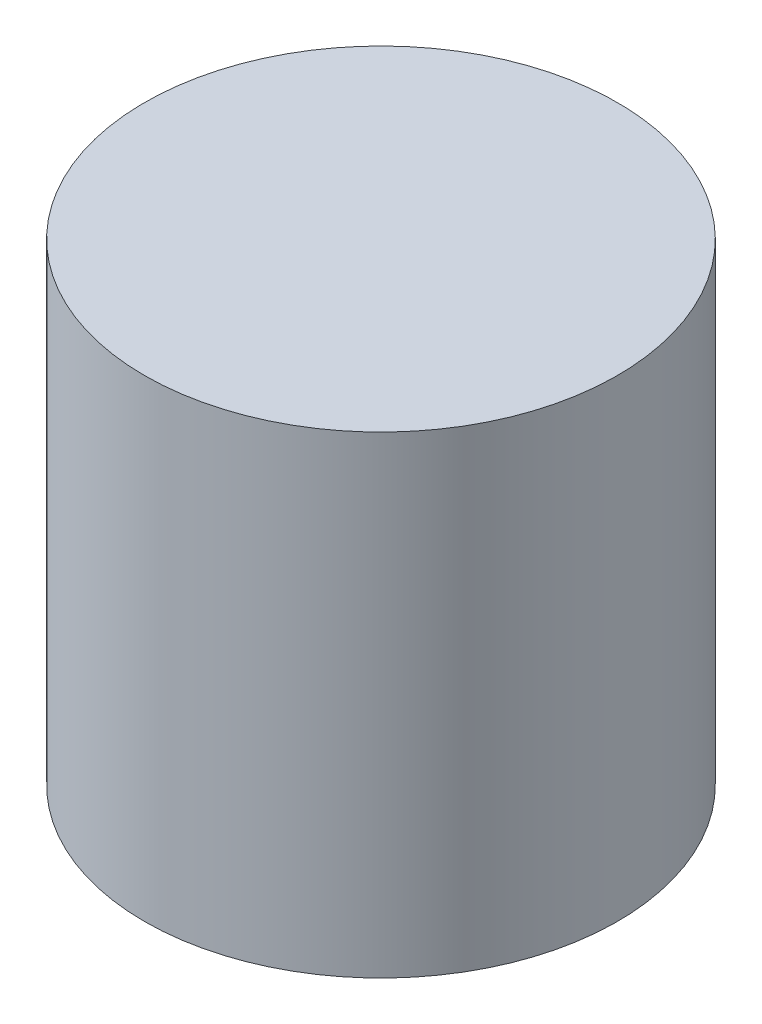
ISO-10303-21;
HEADER;
FILE_DESCRIPTION(('STEP AP214'),'2;1');
FILE_NAME('part.step','',(''),(''),'','','');
FILE_SCHEMA(('AUTOMOTIVE_DESIGN { 1 0 10303 214 1 1 1 1 }'));
ENDSEC;
DATA;
#1=APPLICATION_CONTEXT('core data for automotive mechanical design processes');
#2=APPLICATION_PROTOCOL_DEFINITION('international standard','automotive_design',2000,#1);
#3=PRODUCT_CONTEXT('',#1,'mechanical');
#4=PRODUCT('Part','Part','',(#3));
#5=PRODUCT_RELATED_PRODUCT_CATEGORY('part','',(#4));
#6=PRODUCT_DEFINITION_FORMATION('','',#4);
#7=PRODUCT_DEFINITION_CONTEXT('part definition',#1,'design');
#8=PRODUCT_DEFINITION('design','',#6,#7);
#9=PRODUCT_DEFINITION_SHAPE('','',#8);
#10=(LENGTH_UNIT() NAMED_UNIT(*) SI_UNIT(.MILLI.,.METRE.));
#11=(NAMED_UNIT(*) PLANE_ANGLE_UNIT() SI_UNIT($,.RADIAN.));
#12=(NAMED_UNIT(*) SI_UNIT($,.STERADIAN.) SOLID_ANGLE_UNIT());
#13=UNCERTAINTY_MEASURE_WITH_UNIT(LENGTH_MEASURE(1.E-05),#10,'distance_accuracy_value','');
#14=(GEOMETRIC_REPRESENTATION_CONTEXT(3) GLOBAL_UNCERTAINTY_ASSIGNED_CONTEXT((#13)) GLOBAL_UNIT_ASSIGNED_CONTEXT((#10,
#11,#12)) REPRESENTATION_CONTEXT('',''));
#15=CARTESIAN_POINT('',(0.,0.,0.));
#16=DIRECTION('',(0.,0.,1.));
#17=DIRECTION('',(1.,0.,0.));
#18=AXIS2_PLACEMENT_3D('',#15,#16,#17);
#19=CARTESIAN_POINT('',(0.,6.,0.));
#20=DIRECTION('',(0.,-1.,0.));
#21=DIRECTION('',(0.,0.,-1.));
#22=AXIS2_PLACEMENT_3D('',#19,#20,#21);
#23=CYLINDRICAL_SURFACE('',#22,3.);
#24=CARTESIAN_POINT('',(0.,6.,0.));
#25=DIRECTION('',(0.,1.,0.));
#26=DIRECTION('',(0.,0.,1.));
#27=AXIS2_PLACEMENT_3D('',#24,#25,#26);
#28=CIRCLE('',#27,3.);
#29=CARTESIAN_POINT('',(0.,6.,3.));
#30=VERTEX_POINT('',#29);
#31=EDGE_CURVE('E10',#30,#30,#28,.T.);
#32=ORIENTED_EDGE('',*,*,#31,.F.);
#33=EDGE_LOOP('',(#32));
#34=FACE_BOUND('',#33,.T.);
#35=CARTESIAN_POINT('',(0.,0.,0.));
#36=DIRECTION('',(0.,1.,0.));
#37=DIRECTION('',(0.,0.,1.));
#38=AXIS2_PLACEMENT_3D('',#35,#36,#37);
#39=CIRCLE('',#38,3.);
#40=CARTESIAN_POINT('',(0.,0.,3.));
#41=VERTEX_POINT('',#40);
#42=EDGE_CURVE('E34',#41,#41,#39,.T.);
#43=ORIENTED_EDGE('',*,*,#42,.T.);
#44=EDGE_LOOP('',(#43));
#45=FACE_BOUND('',#44,.T.);
#46=ADVANCED_FACE('F31',(#34,#45),#23,.T.);
#47=CARTESIAN_POINT('',(0.,6.,0.));
#48=DIRECTION('',(0.,1.,0.));
#49=DIRECTION('',(0.,0.,1.));
#50=AXIS2_PLACEMENT_3D('',#47,#48,#49);
#51=PLANE('',#50);
#52=ORIENTED_EDGE('',*,*,#31,.T.);
#53=EDGE_LOOP('',(#52));
#54=FACE_BOUND('',#53,.T.);
#55=ADVANCED_FACE('F46',(#54),#51,.T.);
#56=CARTESIAN_POINT('',(0.,0.,0.));
#57=DIRECTION('',(0.,1.,0.));
#58=DIRECTION('',(0.,0.,1.));
#59=AXIS2_PLACEMENT_3D('',#56,#57,#58);
#60=PLANE('',#59);
#61=ORIENTED_EDGE('',*,*,#42,.F.);
#62=EDGE_LOOP('',(#61));
#63=FACE_BOUND('',#62,.T.);
#64=ADVANCED_FACE('F44',(#63),#60,.F.);
#65=CLOSED_SHELL('',(#46,#55,#64));
#66=MANIFOLD_SOLID_BREP('B2',#65);
#67=ADVANCED_BREP_SHAPE_REPRESENTATION('',(#18,#66),#14);
#68=SHAPE_DEFINITION_REPRESENTATION(#9,#67);
ENDSEC;
END-ISO-10303-21;
